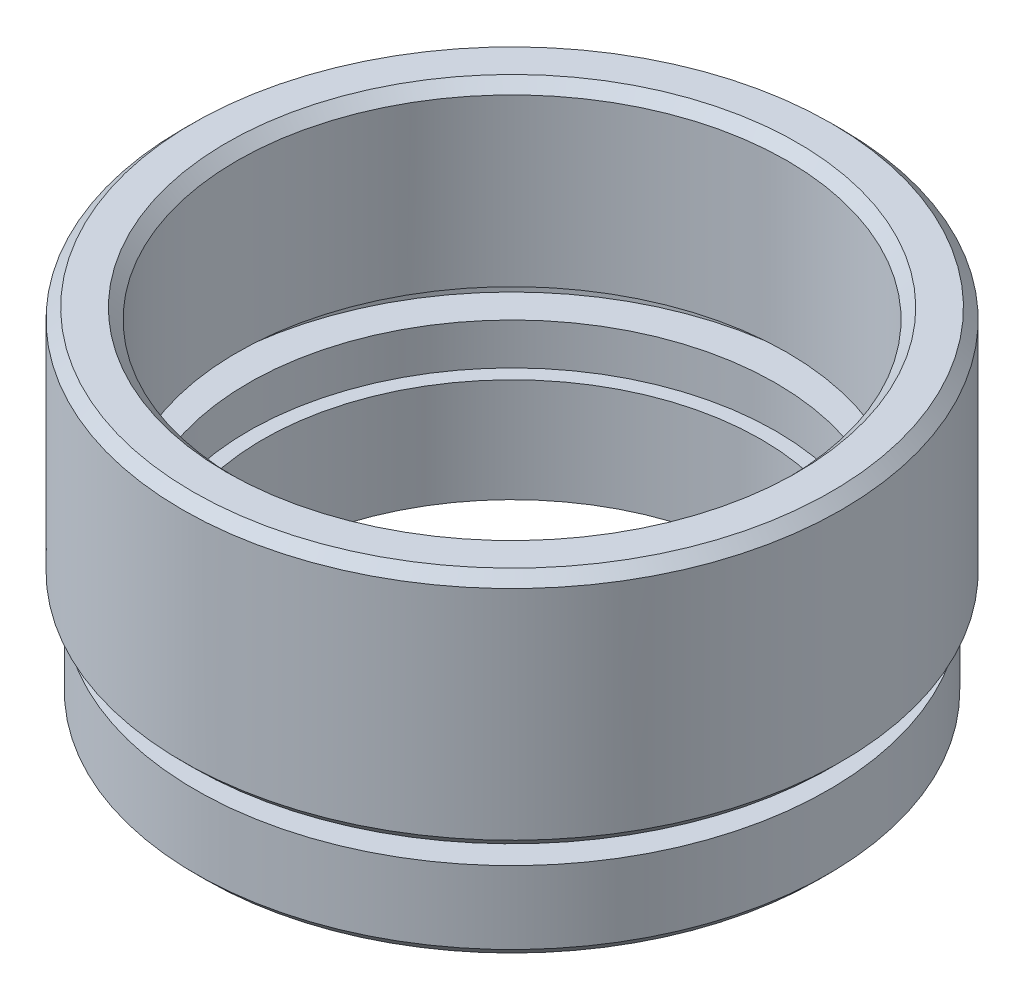
ISO-10303-21;
HEADER;
FILE_DESCRIPTION(('STEP AP214'),'2;1');
FILE_NAME('part.step','',(''),(''),'','','');
FILE_SCHEMA(('AUTOMOTIVE_DESIGN { 1 0 10303 214 1 1 1 1 }'));
ENDSEC;
DATA;
#1=APPLICATION_CONTEXT('core data for automotive mechanical design processes');
#2=APPLICATION_PROTOCOL_DEFINITION('international standard','automotive_design',2000,#1);
#3=PRODUCT_CONTEXT('',#1,'mechanical');
#4=PRODUCT('Part','Part','',(#3));
#5=PRODUCT_RELATED_PRODUCT_CATEGORY('part','',(#4));
#6=PRODUCT_DEFINITION_FORMATION('','',#4);
#7=PRODUCT_DEFINITION_CONTEXT('part definition',#1,'design');
#8=PRODUCT_DEFINITION('design','',#6,#7);
#9=PRODUCT_DEFINITION_SHAPE('','',#8);
#10=(LENGTH_UNIT() NAMED_UNIT(*) SI_UNIT(.MILLI.,.METRE.));
#11=(NAMED_UNIT(*) PLANE_ANGLE_UNIT() SI_UNIT($,.RADIAN.));
#12=(NAMED_UNIT(*) SI_UNIT($,.STERADIAN.) SOLID_ANGLE_UNIT());
#13=UNCERTAINTY_MEASURE_WITH_UNIT(LENGTH_MEASURE(1.E-05),#10,'distance_accuracy_value','');
#14=(GEOMETRIC_REPRESENTATION_CONTEXT(3) GLOBAL_UNCERTAINTY_ASSIGNED_CONTEXT((#13)) GLOBAL_UNIT_ASSIGNED_CONTEXT((#10,
#11,#12)) REPRESENTATION_CONTEXT('',''));
#15=CARTESIAN_POINT('',(0.,0.,0.));
#16=DIRECTION('',(0.,0.,1.));
#17=DIRECTION('',(1.,0.,0.));
#18=AXIS2_PLACEMENT_3D('',#15,#16,#17);
#19=CARTESIAN_POINT('',(0.,0.,0.));
#20=DIRECTION('',(0.,-1.,0.));
#21=DIRECTION('',(0.,0.,-1.));
#22=AXIS2_PLACEMENT_3D('',#19,#20,#21);
#23=CYLINDRICAL_SURFACE('',#22,12.);
#24=CARTESIAN_POINT('',(0.,0.,0.));
#25=DIRECTION('',(0.,-1.,0.));
#26=DIRECTION('',(0.,0.,-1.));
#27=AXIS2_PLACEMENT_3D('',#24,#25,#26);
#28=CIRCLE('',#27,12.);
#29=CARTESIAN_POINT('',(0.,0.,-12.));
#30=VERTEX_POINT('',#29);
#31=EDGE_CURVE('E80',#30,#30,#28,.T.);
#32=ORIENTED_EDGE('',*,*,#31,.T.);
#33=EDGE_LOOP('',(#32));
#34=FACE_BOUND('',#33,.T.);
#35=CARTESIAN_POINT('',(0.,5.,0.));
#36=DIRECTION('',(0.,-1.,0.));
#37=DIRECTION('',(0.,0.,-1.));
#38=AXIS2_PLACEMENT_3D('',#35,#36,#37);
#39=CIRCLE('',#38,12.);
#40=CARTESIAN_POINT('',(0.,5.,-12.));
#41=VERTEX_POINT('',#40);
#42=EDGE_CURVE('E115',#41,#41,#39,.T.);
#43=ORIENTED_EDGE('',*,*,#42,.F.);
#44=EDGE_LOOP('',(#43));
#45=FACE_BOUND('',#44,.T.);
#46=ADVANCED_FACE('F39',(#34,#45),#23,.F.);
#47=CARTESIAN_POINT('',(12.,0.,0.));
#48=DIRECTION('',(0.,-1.,0.));
#49=DIRECTION('',(0.,0.,-1.));
#50=AXIS2_PLACEMENT_3D('',#47,#48,#49);
#51=PLANE('',#50);
#52=CARTESIAN_POINT('',(0.,0.,0.));
#53=DIRECTION('',(0.,-1.,0.));
#54=DIRECTION('',(0.,0.,-1.));
#55=AXIS2_PLACEMENT_3D('',#52,#53,#54);
#56=CIRCLE('',#55,14.75);
#57=CARTESIAN_POINT('',(0.,0.,-14.75));
#58=VERTEX_POINT('',#57);
#59=EDGE_CURVE('E47',#58,#58,#56,.T.);
#60=ORIENTED_EDGE('',*,*,#59,.T.);
#61=EDGE_LOOP('',(#60));
#62=FACE_BOUND('',#61,.T.);
#63=ORIENTED_EDGE('',*,*,#31,.F.);
#64=EDGE_LOOP('',(#63));
#65=FACE_BOUND('',#64,.T.);
#66=ADVANCED_FACE('F124',(#62,#65),#51,.T.);
#67=CARTESIAN_POINT('',(0.,0.,0.));
#68=DIRECTION('',(0.,-1.,0.));
#69=DIRECTION('',(0.,0.,-1.));
#70=AXIS2_PLACEMENT_3D('',#67,#68,#69);
#71=CYLINDRICAL_SURFACE('',#70,15.25);
#72=CARTESIAN_POINT('',(0.,0.499999999999999,0.));
#73=DIRECTION('',(0.,-1.,0.));
#74=DIRECTION('',(0.,0.,-1.));
#75=AXIS2_PLACEMENT_3D('',#72,#73,#74);
#76=CIRCLE('',#75,15.25);
#77=CARTESIAN_POINT('',(0.,0.499999999999999,-15.25));
#78=VERTEX_POINT('',#77);
#79=EDGE_CURVE('E10',#78,#78,#76,.F.);
#80=ORIENTED_EDGE('',*,*,#79,.T.);
#81=EDGE_LOOP('',(#80));
#82=FACE_BOUND('',#81,.T.);
#83=CARTESIAN_POINT('',(0.,4.,0.));
#84=DIRECTION('',(0.,-1.,0.));
#85=DIRECTION('',(0.,0.,-1.));
#86=AXIS2_PLACEMENT_3D('',#83,#84,#85);
#87=CIRCLE('',#86,15.25);
#88=CARTESIAN_POINT('',(0.,4.,-15.25));
#89=VERTEX_POINT('',#88);
#90=EDGE_CURVE('E83',#89,#89,#87,.T.);
#91=ORIENTED_EDGE('',*,*,#90,.T.);
#92=EDGE_LOOP('',(#91));
#93=FACE_BOUND('',#92,.T.);
#94=ADVANCED_FACE('F130',(#82,#93),#71,.T.);
#95=CARTESIAN_POINT('',(15.25,4.,0.));
#96=DIRECTION('',(0.,1.,0.));
#97=DIRECTION('',(0.,0.,1.));
#98=AXIS2_PLACEMENT_3D('',#95,#96,#97);
#99=PLANE('',#98);
#100=CARTESIAN_POINT('',(0.,4.,0.));
#101=DIRECTION('',(0.,-1.,0.));
#102=DIRECTION('',(0.,0.,-1.));
#103=AXIS2_PLACEMENT_3D('',#100,#101,#102);
#104=CIRCLE('',#103,13.75);
#105=CARTESIAN_POINT('',(0.,4.,-13.75));
#106=VERTEX_POINT('',#105);
#107=EDGE_CURVE('E87',#106,#106,#104,.T.);
#108=ORIENTED_EDGE('',*,*,#107,.T.);
#109=EDGE_LOOP('',(#108));
#110=FACE_BOUND('',#109,.T.);
#111=ORIENTED_EDGE('',*,*,#90,.F.);
#112=EDGE_LOOP('',(#111));
#113=FACE_BOUND('',#112,.T.);
#114=ADVANCED_FACE('F162',(#110,#113),#99,.T.);
#115=CARTESIAN_POINT('',(0.,0.,0.));
#116=DIRECTION('',(0.,-1.,0.));
#117=DIRECTION('',(0.,0.,-1.));
#118=AXIS2_PLACEMENT_3D('',#115,#116,#117);
#119=CYLINDRICAL_SURFACE('',#118,13.75);
#120=CARTESIAN_POINT('',(0.,5.,0.));
#121=DIRECTION('',(0.,-1.,0.));
#122=DIRECTION('',(0.,0.,-1.));
#123=AXIS2_PLACEMENT_3D('',#120,#121,#122);
#124=CIRCLE('',#123,13.75);
#125=CARTESIAN_POINT('',(0.,5.,-13.75));
#126=VERTEX_POINT('',#125);
#127=EDGE_CURVE('E91',#126,#126,#124,.T.);
#128=ORIENTED_EDGE('',*,*,#127,.T.);
#129=EDGE_LOOP('',(#128));
#130=FACE_BOUND('',#129,.T.);
#131=ORIENTED_EDGE('',*,*,#107,.F.);
#132=EDGE_LOOP('',(#131));
#133=FACE_BOUND('',#132,.T.);
#134=ADVANCED_FACE('F156',(#130,#133),#119,.T.);
#135=CARTESIAN_POINT('',(13.75,5.,0.));
#136=DIRECTION('',(0.,-1.,0.));
#137=DIRECTION('',(0.,0.,-1.));
#138=AXIS2_PLACEMENT_3D('',#135,#136,#137);
#139=PLANE('',#138);
#140=CARTESIAN_POINT('',(0.,5.,0.));
#141=DIRECTION('',(0.,-1.,0.));
#142=DIRECTION('',(0.,0.,-1.));
#143=AXIS2_PLACEMENT_3D('',#140,#141,#142);
#144=CIRCLE('',#143,15.375);
#145=CARTESIAN_POINT('',(0.,5.,-15.375));
#146=VERTEX_POINT('',#145);
#147=EDGE_CURVE('E53',#146,#146,#144,.T.);
#148=ORIENTED_EDGE('',*,*,#147,.T.);
#149=EDGE_LOOP('',(#148));
#150=FACE_BOUND('',#149,.T.);
#151=ORIENTED_EDGE('',*,*,#127,.F.);
#152=EDGE_LOOP('',(#151));
#153=FACE_BOUND('',#152,.T.);
#154=ADVANCED_FACE('F152',(#150,#153),#139,.T.);
#155=CARTESIAN_POINT('',(0.,0.,0.));
#156=DIRECTION('',(0.,-1.,0.));
#157=DIRECTION('',(0.,0.,-1.));
#158=AXIS2_PLACEMENT_3D('',#155,#156,#157);
#159=CYLINDRICAL_SURFACE('',#158,15.875);
#160=CARTESIAN_POINT('',(0.,16.,0.));
#161=DIRECTION('',(0.,1.,0.));
#162=DIRECTION('',(0.,0.,1.));
#163=AXIS2_PLACEMENT_3D('',#160,#161,#162);
#164=CIRCLE('',#163,15.875);
#165=CARTESIAN_POINT('',(0.,16.,15.875));
#166=VERTEX_POINT('',#165);
#167=EDGE_CURVE('E59',#166,#166,#164,.F.);
#168=ORIENTED_EDGE('',*,*,#167,.T.);
#169=EDGE_LOOP('',(#168));
#170=FACE_BOUND('',#169,.T.);
#171=CARTESIAN_POINT('',(0.,5.5,0.));
#172=DIRECTION('',(0.,-1.,0.));
#173=DIRECTION('',(0.,0.,-1.));
#174=AXIS2_PLACEMENT_3D('',#171,#172,#173);
#175=CIRCLE('',#174,15.875);
#176=CARTESIAN_POINT('',(0.,5.5,-15.875));
#177=VERTEX_POINT('',#176);
#178=EDGE_CURVE('E65',#177,#177,#175,.F.);
#179=ORIENTED_EDGE('',*,*,#178,.T.);
#180=EDGE_LOOP('',(#179));
#181=FACE_BOUND('',#180,.T.);
#182=ADVANCED_FACE('F155',(#170,#181),#159,.T.);
#183=CARTESIAN_POINT('',(15.875,16.5,0.));
#184=DIRECTION('',(0.,1.,0.));
#185=DIRECTION('',(0.,0.,1.));
#186=AXIS2_PLACEMENT_3D('',#183,#184,#185);
#187=PLANE('',#186);
#188=CARTESIAN_POINT('',(0.,16.5,0.));
#189=DIRECTION('',(0.,1.,0.));
#190=DIRECTION('',(0.,0.,1.));
#191=AXIS2_PLACEMENT_3D('',#188,#189,#190);
#192=CIRCLE('',#191,13.75);
#193=CARTESIAN_POINT('',(0.,16.5,13.75));
#194=VERTEX_POINT('',#193);
#195=EDGE_CURVE('E72',#194,#194,#192,.F.);
#196=ORIENTED_EDGE('',*,*,#195,.T.);
#197=EDGE_LOOP('',(#196));
#198=FACE_BOUND('',#197,.T.);
#199=CARTESIAN_POINT('',(0.,16.5,0.));
#200=DIRECTION('',(0.,1.,0.));
#201=DIRECTION('',(0.,0.,1.));
#202=AXIS2_PLACEMENT_3D('',#199,#200,#201);
#203=CIRCLE('',#202,15.375);
#204=CARTESIAN_POINT('',(0.,16.5,15.375));
#205=VERTEX_POINT('',#204);
#206=EDGE_CURVE('E76',#205,#205,#203,.T.);
#207=ORIENTED_EDGE('',*,*,#206,.T.);
#208=EDGE_LOOP('',(#207));
#209=FACE_BOUND('',#208,.T.);
#210=ADVANCED_FACE('F177',(#198,#209),#187,.T.);
#211=CARTESIAN_POINT('',(0.,0.,0.));
#212=DIRECTION('',(0.,-1.,0.));
#213=DIRECTION('',(0.,0.,-1.));
#214=AXIS2_PLACEMENT_3D('',#211,#212,#213);
#215=CYLINDRICAL_SURFACE('',#214,13.25);
#216=CARTESIAN_POINT('',(0.,16.,0.));
#217=DIRECTION('',(0.,1.,0.));
#218=DIRECTION('',(0.,0.,1.));
#219=AXIS2_PLACEMENT_3D('',#216,#217,#218);
#220=CIRCLE('',#219,13.25);
#221=CARTESIAN_POINT('',(0.,16.,13.25));
#222=VERTEX_POINT('',#221);
#223=EDGE_CURVE('E68',#222,#222,#220,.T.);
#224=ORIENTED_EDGE('',*,*,#223,.T.);
#225=EDGE_LOOP('',(#224));
#226=FACE_BOUND('',#225,.T.);
#227=CARTESIAN_POINT('',(0.,8.,0.));
#228=DIRECTION('',(0.,-1.,0.));
#229=DIRECTION('',(0.,0.,-1.));
#230=AXIS2_PLACEMENT_3D('',#227,#228,#229);
#231=CIRCLE('',#230,13.25);
#232=CARTESIAN_POINT('',(0.,8.,-13.25));
#233=VERTEX_POINT('',#232);
#234=EDGE_CURVE('E95',#233,#233,#231,.T.);
#235=ORIENTED_EDGE('',*,*,#234,.T.);
#236=EDGE_LOOP('',(#235));
#237=FACE_BOUND('',#236,.T.);
#238=ADVANCED_FACE('F181',(#226,#237),#215,.F.);
#239=CARTESIAN_POINT('',(13.25,8.,0.));
#240=DIRECTION('',(0.,-1.,0.));
#241=DIRECTION('',(0.,0.,-1.));
#242=AXIS2_PLACEMENT_3D('',#239,#240,#241);
#243=PLANE('',#242);
#244=CARTESIAN_POINT('',(0.,8.,0.));
#245=DIRECTION('',(0.,-1.,0.));
#246=DIRECTION('',(0.,0.,-1.));
#247=AXIS2_PLACEMENT_3D('',#244,#245,#246);
#248=CIRCLE('',#247,14.35);
#249=CARTESIAN_POINT('',(0.,8.,-14.35));
#250=VERTEX_POINT('',#249);
#251=EDGE_CURVE('E99',#250,#250,#248,.T.);
#252=ORIENTED_EDGE('',*,*,#251,.T.);
#253=EDGE_LOOP('',(#252));
#254=FACE_BOUND('',#253,.T.);
#255=ORIENTED_EDGE('',*,*,#234,.F.);
#256=EDGE_LOOP('',(#255));
#257=FACE_BOUND('',#256,.T.);
#258=ADVANCED_FACE('F185',(#254,#257),#243,.T.);
#259=CARTESIAN_POINT('',(0.,0.,0.));
#260=DIRECTION('',(0.,-1.,0.));
#261=DIRECTION('',(0.,0.,-1.));
#262=AXIS2_PLACEMENT_3D('',#259,#260,#261);
#263=CYLINDRICAL_SURFACE('',#262,14.35);
#264=CARTESIAN_POINT('',(0.,7.,0.));
#265=DIRECTION('',(0.,-1.,0.));
#266=DIRECTION('',(0.,0.,-1.));
#267=AXIS2_PLACEMENT_3D('',#264,#265,#266);
#268=CIRCLE('',#267,14.35);
#269=CARTESIAN_POINT('',(0.,7.,-14.35));
#270=VERTEX_POINT('',#269);
#271=EDGE_CURVE('E103',#270,#270,#268,.T.);
#272=ORIENTED_EDGE('',*,*,#271,.T.);
#273=EDGE_LOOP('',(#272));
#274=FACE_BOUND('',#273,.T.);
#275=ORIENTED_EDGE('',*,*,#251,.F.);
#276=EDGE_LOOP('',(#275));
#277=FACE_BOUND('',#276,.T.);
#278=ADVANCED_FACE('F189',(#274,#277),#263,.F.);
#279=CARTESIAN_POINT('',(14.35,7.,0.));
#280=DIRECTION('',(0.,1.,0.));
#281=DIRECTION('',(0.,0.,1.));
#282=AXIS2_PLACEMENT_3D('',#279,#280,#281);
#283=PLANE('',#282);
#284=CARTESIAN_POINT('',(0.,7.,0.));
#285=DIRECTION('',(0.,-1.,0.));
#286=DIRECTION('',(0.,0.,-1.));
#287=AXIS2_PLACEMENT_3D('',#284,#285,#286);
#288=CIRCLE('',#287,12.7);
#289=CARTESIAN_POINT('',(0.,7.,-12.7));
#290=VERTEX_POINT('',#289);
#291=EDGE_CURVE('E107',#290,#290,#288,.T.);
#292=ORIENTED_EDGE('',*,*,#291,.T.);
#293=EDGE_LOOP('',(#292));
#294=FACE_BOUND('',#293,.T.);
#295=ORIENTED_EDGE('',*,*,#271,.F.);
#296=EDGE_LOOP('',(#295));
#297=FACE_BOUND('',#296,.T.);
#298=ADVANCED_FACE('F193',(#294,#297),#283,.T.);
#299=CARTESIAN_POINT('',(0.,0.,0.));
#300=DIRECTION('',(0.,-1.,0.));
#301=DIRECTION('',(0.,0.,-1.));
#302=AXIS2_PLACEMENT_3D('',#299,#300,#301);
#303=CYLINDRICAL_SURFACE('',#302,12.7);
#304=CARTESIAN_POINT('',(0.,5.,0.));
#305=DIRECTION('',(0.,-1.,0.));
#306=DIRECTION('',(0.,0.,-1.));
#307=AXIS2_PLACEMENT_3D('',#304,#305,#306);
#308=CIRCLE('',#307,12.7);
#309=CARTESIAN_POINT('',(0.,5.,-12.7));
#310=VERTEX_POINT('',#309);
#311=EDGE_CURVE('E111',#310,#310,#308,.T.);
#312=ORIENTED_EDGE('',*,*,#311,.T.);
#313=EDGE_LOOP('',(#312));
#314=FACE_BOUND('',#313,.T.);
#315=ORIENTED_EDGE('',*,*,#291,.F.);
#316=EDGE_LOOP('',(#315));
#317=FACE_BOUND('',#316,.T.);
#318=ADVANCED_FACE('F197',(#314,#317),#303,.F.);
#319=CARTESIAN_POINT('',(12.7,5.,0.));
#320=DIRECTION('',(0.,1.,0.));
#321=DIRECTION('',(0.,0.,1.));
#322=AXIS2_PLACEMENT_3D('',#319,#320,#321);
#323=PLANE('',#322);
#324=ORIENTED_EDGE('',*,*,#42,.T.);
#325=EDGE_LOOP('',(#324));
#326=FACE_BOUND('',#325,.T.);
#327=ORIENTED_EDGE('',*,*,#311,.F.);
#328=EDGE_LOOP('',(#327));
#329=FACE_BOUND('',#328,.T.);
#330=ADVANCED_FACE('F120',(#326,#329),#323,.T.);
#331=CARTESIAN_POINT('',(0.,16.5,0.));
#332=DIRECTION('',(0.,1.,0.));
#333=DIRECTION('',(0.,0.,1.));
#334=AXIS2_PLACEMENT_3D('',#331,#332,#333);
#335=CONICAL_SURFACE('',#334,13.75,0.785398163397448);
#336=ORIENTED_EDGE('',*,*,#223,.F.);
#337=EDGE_LOOP('',(#336));
#338=FACE_BOUND('',#337,.T.);
#339=ORIENTED_EDGE('',*,*,#195,.F.);
#340=EDGE_LOOP('',(#339));
#341=FACE_BOUND('',#340,.T.);
#342=ADVANCED_FACE('F134',(#338,#341),#335,.F.);
#343=CARTESIAN_POINT('',(0.,16.,0.));
#344=DIRECTION('',(0.,-1.,0.));
#345=DIRECTION('',(0.,0.,-1.));
#346=AXIS2_PLACEMENT_3D('',#343,#344,#345);
#347=CONICAL_SURFACE('',#346,15.875,0.785398163397448);
#348=ORIENTED_EDGE('',*,*,#206,.F.);
#349=EDGE_LOOP('',(#348));
#350=FACE_BOUND('',#349,.T.);
#351=ORIENTED_EDGE('',*,*,#167,.F.);
#352=EDGE_LOOP('',(#351));
#353=FACE_BOUND('',#352,.T.);
#354=ADVANCED_FACE('F137',(#350,#353),#347,.T.);
#355=CARTESIAN_POINT('',(0.,5.,0.));
#356=DIRECTION('',(0.,1.,0.));
#357=DIRECTION('',(0.,0.,1.));
#358=AXIS2_PLACEMENT_3D('',#355,#356,#357);
#359=CONICAL_SURFACE('',#358,15.375,0.785398163397452);
#360=ORIENTED_EDGE('',*,*,#178,.F.);
#361=EDGE_LOOP('',(#360));
#362=FACE_BOUND('',#361,.T.);
#363=ORIENTED_EDGE('',*,*,#147,.F.);
#364=EDGE_LOOP('',(#363));
#365=FACE_BOUND('',#364,.T.);
#366=ADVANCED_FACE('F140',(#362,#365),#359,.T.);
#367=CARTESIAN_POINT('',(0.,0.,0.));
#368=DIRECTION('',(0.,1.,0.));
#369=DIRECTION('',(0.,0.,1.));
#370=AXIS2_PLACEMENT_3D('',#367,#368,#369);
#371=CONICAL_SURFACE('',#370,14.75,0.785398163397443);
#372=ORIENTED_EDGE('',*,*,#79,.F.);
#373=EDGE_LOOP('',(#372));
#374=FACE_BOUND('',#373,.T.);
#375=ORIENTED_EDGE('',*,*,#59,.F.);
#376=EDGE_LOOP('',(#375));
#377=FACE_BOUND('',#376,.T.);
#378=ADVANCED_FACE('F41',(#374,#377),#371,.T.);
#379=CLOSED_SHELL('',(#46,#66,#94,#114,#134,#154,#182,#210,#238,#258,#278,#298,#318,#330,#342,
#354,#366,#378));
#380=MANIFOLD_SOLID_BREP('B2',#379);
#381=ADVANCED_BREP_SHAPE_REPRESENTATION('',(#18,#380),#14);
#382=SHAPE_DEFINITION_REPRESENTATION(#9,#381);
ENDSEC;
END-ISO-10303-21;
